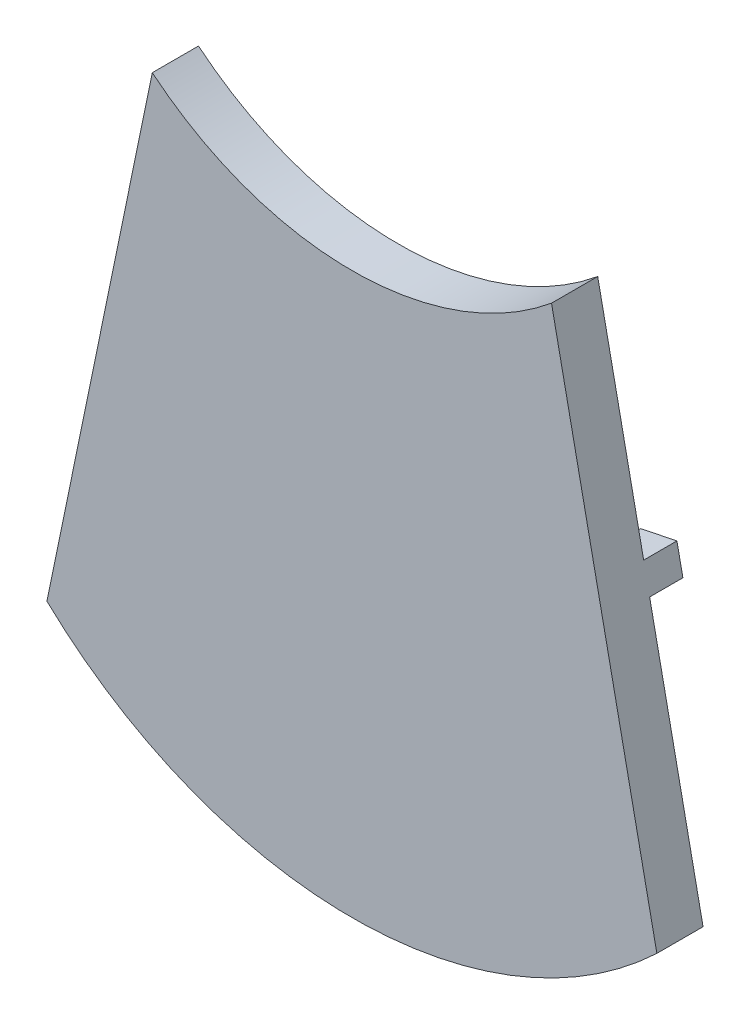
ISO-10303-21;
HEADER;
FILE_DESCRIPTION(('STEP AP214'),'2;1');
FILE_NAME('part.step','',(''),(''),'','','');
FILE_SCHEMA(('AUTOMOTIVE_DESIGN { 1 0 10303 214 1 1 1 1 }'));
ENDSEC;
DATA;
#1=APPLICATION_CONTEXT('core data for automotive mechanical design processes');
#2=APPLICATION_PROTOCOL_DEFINITION('international standard','automotive_design',2000,#1);
#3=PRODUCT_CONTEXT('',#1,'mechanical');
#4=PRODUCT('Part','Part','',(#3));
#5=PRODUCT_RELATED_PRODUCT_CATEGORY('part','',(#4));
#6=PRODUCT_DEFINITION_FORMATION('','',#4);
#7=PRODUCT_DEFINITION_CONTEXT('part definition',#1,'design');
#8=PRODUCT_DEFINITION('design','',#6,#7);
#9=PRODUCT_DEFINITION_SHAPE('','',#8);
#10=(LENGTH_UNIT() NAMED_UNIT(*) SI_UNIT(.MILLI.,.METRE.));
#11=(NAMED_UNIT(*) PLANE_ANGLE_UNIT() SI_UNIT($,.RADIAN.));
#12=(NAMED_UNIT(*) SI_UNIT($,.STERADIAN.) SOLID_ANGLE_UNIT());
#13=UNCERTAINTY_MEASURE_WITH_UNIT(LENGTH_MEASURE(1.E-05),#10,'distance_accuracy_value','');
#14=(GEOMETRIC_REPRESENTATION_CONTEXT(3) GLOBAL_UNCERTAINTY_ASSIGNED_CONTEXT((#13)) GLOBAL_UNIT_ASSIGNED_CONTEXT((#10,
#11,#12)) REPRESENTATION_CONTEXT('',''));
#15=CARTESIAN_POINT('',(0.,0.,0.));
#16=DIRECTION('',(0.,0.,1.));
#17=DIRECTION('',(1.,0.,0.));
#18=AXIS2_PLACEMENT_3D('',#15,#16,#17);
#19=CARTESIAN_POINT('',(104.775,110.670499117877,0.));
#20=DIRECTION('',(0.,0.,1.));
#21=DIRECTION('',(1.,0.,0.));
#22=AXIS2_PLACEMENT_3D('',#19,#20,#21);
#23=PLANE('',#22);
#24=DIRECTION('',(-0.979359182953296,-0.202127659574469,0.));
#25=VECTOR('',#24,1.);
#26=CARTESIAN_POINT('',(189.142180851064,98.8809999068796,0.));
#27=LINE('',#26,#25);
#28=CARTESIAN_POINT('',(189.142180851064,98.8809999068796,0.));
#29=VERTEX_POINT('',#28);
#30=CARTESIAN_POINT('',(176.704319227557,96.3139786302838,0.));
#31=VERTEX_POINT('',#30);
#32=EDGE_CURVE('E254',#29,#31,#27,.T.);
#33=ORIENTED_EDGE('',*,*,#32,.T.);
#34=DIRECTION('',(-0.202127659574468,0.979359182953296,0.));
#35=VECTOR('',#34,1.);
#36=CARTESIAN_POINT('',(170.923651063987,124.322765065139,0.));
#37=LINE('',#36,#35);
#38=CARTESIAN_POINT('',(164.783678837267,154.072469761542,0.));
#39=VERTEX_POINT('',#38);
#40=EDGE_CURVE('E216',#31,#39,#37,.T.);
#41=ORIENTED_EDGE('',*,*,#40,.T.);
#42=CARTESIAN_POINT('',(104.775,258.74042552741,0.));
#43=DIRECTION('',(0.,0.,1.));
#44=DIRECTION('',(1.,0.,0.));
#45=AXIS2_PLACEMENT_3D('',#42,#43,#44);
#46=CIRCLE('',#45,120.65);
#47=CARTESIAN_POINT('',(44.7663211627325,154.072469761542,0.));
#48=VERTEX_POINT('',#47);
#49=EDGE_CURVE('E11',#39,#48,#46,.F.);
#50=ORIENTED_EDGE('',*,*,#49,.T.);
#51=DIRECTION('',(-0.202127659574468,-0.979359182953296,0.));
#52=VECTOR('',#51,1.);
#53=CARTESIAN_POINT('',(38.6263489360134,124.322765065139,0.));
#54=LINE('',#53,#52);
#55=CARTESIAN_POINT('',(32.845680772443,96.3139786302838,0.));
#56=VERTEX_POINT('',#55);
#57=EDGE_CURVE('E227',#48,#56,#54,.T.);
#58=ORIENTED_EDGE('',*,*,#57,.T.);
#59=DIRECTION('',(-0.979359182953296,0.202127659574468,0.));
#60=VECTOR('',#59,1.);
#61=CARTESIAN_POINT('',(20.4078191489361,98.8809999068795,0.));
#62=LINE('',#61,#60);
#63=CARTESIAN_POINT('',(20.4078191489362,98.8809999068795,0.));
#64=VERTEX_POINT('',#63);
#65=EDGE_CURVE('E283',#56,#64,#62,.T.);
#66=ORIENTED_EDGE('',*,*,#65,.T.);
#67=DIRECTION('',(-0.202127659574468,-0.979359182953296,0.));
#68=VECTOR('',#67,1.);
#69=CARTESIAN_POINT('',(0.,0.,0.));
#70=LINE('',#69,#68);
#71=CARTESIAN_POINT('',(36.195,175.373848891447,0.));
#72=VERTEX_POINT('',#71);
#73=EDGE_CURVE('E301',#72,#64,#70,.T.);
#74=ORIENTED_EDGE('',*,*,#73,.F.);
#75=CARTESIAN_POINT('',(104.775,258.74042552741,0.));
#76=DIRECTION('',(0.,0.,-1.));
#77=DIRECTION('',(1.,0.,0.));
#78=AXIS2_PLACEMENT_3D('',#75,#76,#77);
#79=CIRCLE('',#78,107.95);
#80=CARTESIAN_POINT('',(173.355,175.373848891447,0.));
#81=VERTEX_POINT('',#80);
#82=EDGE_CURVE('E314',#81,#72,#79,.T.);
#83=ORIENTED_EDGE('',*,*,#82,.F.);
#84=DIRECTION('',(-0.202127659574468,0.979359182953296,0.));
#85=VECTOR('',#84,1.);
#86=CARTESIAN_POINT('',(173.355,175.373848891447,0.));
#87=LINE('',#86,#85);
#88=EDGE_CURVE('E310',#29,#81,#87,.T.);
#89=ORIENTED_EDGE('',*,*,#88,.F.);
#90=EDGE_LOOP('',(#33,#41,#50,#58,#66,#74,#83,#89));
#91=FACE_BOUND('',#90,.T.);
#92=ADVANCED_FACE('F32',(#91),#23,.F.);
#93=CARTESIAN_POINT('',(104.775,110.670499117877,15.875));
#94=DIRECTION('',(0.,0.,-1.));
#95=DIRECTION('',(-1.,0.,0.));
#96=AXIS2_PLACEMENT_3D('',#93,#94,#95);
#97=CYLINDRICAL_SURFACE('',#96,152.4);
#98=CARTESIAN_POINT('',(104.775,110.670499117877,0.));
#99=DIRECTION('',(0.,0.,1.));
#100=DIRECTION('',(1.,0.,0.));
#101=AXIS2_PLACEMENT_3D('',#98,#99,#100);
#102=CIRCLE('',#101,152.4);
#103=CARTESIAN_POINT('',(0.,0.,0.));
#104=VERTEX_POINT('',#103);
#105=CARTESIAN_POINT('',(209.55,0.,0.));
#106=VERTEX_POINT('',#105);
#107=EDGE_CURVE('E295',#104,#106,#102,.T.);
#108=ORIENTED_EDGE('',*,*,#107,.T.);
#109=DIRECTION('',(0.,0.,-1.));
#110=VECTOR('',#109,1.);
#111=CARTESIAN_POINT('',(209.55,0.,15.875));
#112=LINE('',#111,#110);
#113=CARTESIAN_POINT('',(209.55,0.,15.875));
#114=VERTEX_POINT('',#113);
#115=EDGE_CURVE('E40',#114,#106,#112,.T.);
#116=ORIENTED_EDGE('',*,*,#115,.F.);
#117=CARTESIAN_POINT('',(104.775,110.670499117877,15.875));
#118=DIRECTION('',(0.,0.,1.));
#119=DIRECTION('',(1.,0.,0.));
#120=AXIS2_PLACEMENT_3D('',#117,#118,#119);
#121=CIRCLE('',#120,152.4);
#122=CARTESIAN_POINT('',(0.,0.,15.875));
#123=VERTEX_POINT('',#122);
#124=EDGE_CURVE('E297',#123,#114,#121,.T.);
#125=ORIENTED_EDGE('',*,*,#124,.F.);
#126=DIRECTION('',(0.,0.,-1.));
#127=VECTOR('',#126,1.);
#128=CARTESIAN_POINT('',(0.,0.,15.875));
#129=LINE('',#128,#127);
#130=EDGE_CURVE('E307',#123,#104,#129,.T.);
#131=ORIENTED_EDGE('',*,*,#130,.T.);
#132=EDGE_LOOP('',(#108,#116,#125,#131));
#133=FACE_BOUND('',#132,.T.);
#134=ADVANCED_FACE('F34',(#133),#97,.T.);
#135=CARTESIAN_POINT('',(173.355,175.373848891447,15.875));
#136=DIRECTION('',(-0.979359182953296,-0.202127659574468,0.));
#137=DIRECTION('',(0.202127659574468,-0.979359182953296,0.));
#138=AXIS2_PLACEMENT_3D('',#135,#136,#137);
#139=PLANE('',#138);
#140=CARTESIAN_POINT('',(191.19579787234,88.9307106080741,0.));
#141=VERTEX_POINT('',#140);
#142=EDGE_CURVE('E311',#106,#141,#87,.T.);
#143=ORIENTED_EDGE('',*,*,#142,.T.);
#144=DIRECTION('',(0.,0.,1.));
#145=VECTOR('',#144,1.);
#146=CARTESIAN_POINT('',(191.19579787234,88.9307106080741,-11.43));
#147=LINE('',#146,#145);
#148=CARTESIAN_POINT('',(191.19579787234,88.9307106080741,-11.43));
#149=VERTEX_POINT('',#148);
#150=EDGE_CURVE('E274',#149,#141,#147,.T.);
#151=ORIENTED_EDGE('',*,*,#150,.F.);
#152=DIRECTION('',(-0.20212765957447,0.979359182953296,0.));
#153=VECTOR('',#152,1.);
#154=CARTESIAN_POINT('',(191.19579787234,88.9307106080741,-11.43));
#155=LINE('',#154,#153);
#156=CARTESIAN_POINT('',(189.142180851064,98.8809999068796,-11.43));
#157=VERTEX_POINT('',#156);
#158=EDGE_CURVE('E261',#149,#157,#155,.T.);
#159=ORIENTED_EDGE('',*,*,#158,.T.);
#160=DIRECTION('',(0.,0.,1.));
#161=VECTOR('',#160,1.);
#162=CARTESIAN_POINT('',(189.142180851064,98.8809999068796,-11.43));
#163=LINE('',#162,#161);
#164=EDGE_CURVE('E270',#157,#29,#163,.T.);
#165=ORIENTED_EDGE('',*,*,#164,.T.);
#166=ORIENTED_EDGE('',*,*,#88,.T.);
#167=DIRECTION('',(0.,0.,-1.));
#168=VECTOR('',#167,1.);
#169=CARTESIAN_POINT('',(173.355,175.373848891447,15.875));
#170=LINE('',#169,#168);
#171=CARTESIAN_POINT('',(173.355,175.373848891447,15.875));
#172=VERTEX_POINT('',#171);
#173=EDGE_CURVE('E324',#172,#81,#170,.T.);
#174=ORIENTED_EDGE('',*,*,#173,.F.);
#175=DIRECTION('',(-0.202127659574468,0.979359182953296,0.));
#176=VECTOR('',#175,1.);
#177=CARTESIAN_POINT('',(173.355,175.373848891447,15.875));
#178=LINE('',#177,#176);
#179=EDGE_CURVE('E300',#114,#172,#178,.T.);
#180=ORIENTED_EDGE('',*,*,#179,.F.);
#181=ORIENTED_EDGE('',*,*,#115,.T.);
#182=EDGE_LOOP('',(#143,#151,#159,#165,#166,#174,#180,#181));
#183=FACE_BOUND('',#182,.T.);
#184=ADVANCED_FACE('F329',(#183),#139,.F.);
#185=CARTESIAN_POINT('',(104.775,258.74042552741,15.875));
#186=DIRECTION('',(0.,0.,-1.));
#187=DIRECTION('',(-1.,0.,0.));
#188=AXIS2_PLACEMENT_3D('',#185,#186,#187);
#189=CYLINDRICAL_SURFACE('',#188,107.95);
#190=ORIENTED_EDGE('',*,*,#82,.T.);
#191=DIRECTION('',(0.,0.,-1.));
#192=VECTOR('',#191,1.);
#193=CARTESIAN_POINT('',(36.195,175.373848891447,15.875));
#194=LINE('',#193,#192);
#195=CARTESIAN_POINT('',(36.195,175.373848891447,15.875));
#196=VERTEX_POINT('',#195);
#197=EDGE_CURVE('E321',#196,#72,#194,.T.);
#198=ORIENTED_EDGE('',*,*,#197,.F.);
#199=CARTESIAN_POINT('',(104.775,258.74042552741,15.875));
#200=DIRECTION('',(0.,0.,-1.));
#201=DIRECTION('',(1.,0.,0.));
#202=AXIS2_PLACEMENT_3D('',#199,#200,#201);
#203=CIRCLE('',#202,107.95);
#204=EDGE_CURVE('E303',#172,#196,#203,.T.);
#205=ORIENTED_EDGE('',*,*,#204,.F.);
#206=ORIENTED_EDGE('',*,*,#173,.T.);
#207=EDGE_LOOP('',(#190,#198,#205,#206));
#208=FACE_BOUND('',#207,.T.);
#209=ADVANCED_FACE('F357',(#208),#189,.F.);
#210=CARTESIAN_POINT('',(0.,0.,15.875));
#211=DIRECTION('',(0.979359182953296,-0.202127659574468,0.));
#212=DIRECTION('',(0.202127659574468,0.979359182953296,0.));
#213=AXIS2_PLACEMENT_3D('',#210,#211,#212);
#214=PLANE('',#213);
#215=ORIENTED_EDGE('',*,*,#73,.T.);
#216=DIRECTION('',(0.,0.,1.));
#217=VECTOR('',#216,1.);
#218=CARTESIAN_POINT('',(20.4078191489361,98.8809999068795,-11.43));
#219=LINE('',#218,#217);
#220=CARTESIAN_POINT('',(20.4078191489361,98.8809999068795,-11.43));
#221=VERTEX_POINT('',#220);
#222=EDGE_CURVE('E292',#221,#64,#219,.T.);
#223=ORIENTED_EDGE('',*,*,#222,.F.);
#224=DIRECTION('',(-0.202127659574468,-0.979359182953296,0.));
#225=VECTOR('',#224,1.);
#226=CARTESIAN_POINT('',(18.3542021276596,88.930710608074,-11.43));
#227=LINE('',#226,#225);
#228=CARTESIAN_POINT('',(18.3542021276596,88.930710608074,-11.43));
#229=VERTEX_POINT('',#228);
#230=EDGE_CURVE('E279',#221,#229,#227,.T.);
#231=ORIENTED_EDGE('',*,*,#230,.T.);
#232=DIRECTION('',(0.,0.,1.));
#233=VECTOR('',#232,1.);
#234=CARTESIAN_POINT('',(18.3542021276596,88.930710608074,-11.43));
#235=LINE('',#234,#233);
#236=CARTESIAN_POINT('',(18.3542021276596,88.930710608074,0.));
#237=VERTEX_POINT('',#236);
#238=EDGE_CURVE('E288',#229,#237,#235,.T.);
#239=ORIENTED_EDGE('',*,*,#238,.T.);
#240=EDGE_CURVE('E316',#237,#104,#70,.T.);
#241=ORIENTED_EDGE('',*,*,#240,.T.);
#242=ORIENTED_EDGE('',*,*,#130,.F.);
#243=DIRECTION('',(-0.202127659574468,-0.979359182953296,0.));
#244=VECTOR('',#243,1.);
#245=CARTESIAN_POINT('',(0.,0.,15.875));
#246=LINE('',#245,#244);
#247=EDGE_CURVE('E305',#196,#123,#246,.T.);
#248=ORIENTED_EDGE('',*,*,#247,.F.);
#249=ORIENTED_EDGE('',*,*,#197,.T.);
#250=EDGE_LOOP('',(#215,#223,#231,#239,#241,#242,#248,#249));
#251=FACE_BOUND('',#250,.T.);
#252=ADVANCED_FACE('F364',(#251),#214,.F.);
#253=CARTESIAN_POINT('',(104.775,110.670499117877,15.875));
#254=DIRECTION('',(0.,0.,1.));
#255=DIRECTION('',(1.,0.,0.));
#256=AXIS2_PLACEMENT_3D('',#253,#254,#255);
#257=PLANE('',#256);
#258=ORIENTED_EDGE('',*,*,#124,.T.);
#259=ORIENTED_EDGE('',*,*,#179,.T.);
#260=ORIENTED_EDGE('',*,*,#204,.T.);
#261=ORIENTED_EDGE('',*,*,#247,.T.);
#262=EDGE_LOOP('',(#258,#259,#260,#261));
#263=FACE_BOUND('',#262,.T.);
#264=ADVANCED_FACE('F368',(#263),#257,.T.);
#265=CARTESIAN_POINT('',(104.775,110.670499117877,0.));
#266=DIRECTION('',(0.,0.,1.));
#267=DIRECTION('',(1.,0.,0.));
#268=AXIS2_PLACEMENT_3D('',#265,#266,#267);
#269=CIRCLE('',#268,125.363860821211);
#270=CARTESIAN_POINT('',(104.775,-14.6933617033342,0.));
#271=VERTEX_POINT('',#270);
#272=CARTESIAN_POINT('',(192.270924577821,20.8898732441824,0.));
#273=VERTEX_POINT('',#272);
#274=EDGE_CURVE('E208',#271,#273,#269,.T.);
#275=ORIENTED_EDGE('',*,*,#274,.T.);
#276=CARTESIAN_POINT('',(178.757936248834,86.3636893314783,0.));
#277=VERTEX_POINT('',#276);
#278=EDGE_CURVE('E220',#273,#277,#37,.T.);
#279=ORIENTED_EDGE('',*,*,#278,.T.);
#280=DIRECTION('',(0.979359182953296,0.202127659574468,0.));
#281=VECTOR('',#280,1.);
#282=CARTESIAN_POINT('',(172.53900543708,85.0801786931804,0.));
#283=LINE('',#282,#281);
#284=EDGE_CURVE('E265',#277,#141,#283,.T.);
#285=ORIENTED_EDGE('',*,*,#284,.T.);
#286=ORIENTED_EDGE('',*,*,#142,.F.);
#287=ORIENTED_EDGE('',*,*,#107,.F.);
#288=ORIENTED_EDGE('',*,*,#240,.F.);
#289=DIRECTION('',(0.979359182953296,-0.202127659574467,0.));
#290=VECTOR('',#289,1.);
#291=CARTESIAN_POINT('',(37.0109945629199,85.0801786931804,0.));
#292=LINE('',#291,#290);
#293=CARTESIAN_POINT('',(30.7920637511664,86.3636893314783,0.));
#294=VERTEX_POINT('',#293);
#295=EDGE_CURVE('E277',#237,#294,#292,.T.);
#296=ORIENTED_EDGE('',*,*,#295,.T.);
#297=CARTESIAN_POINT('',(17.2790754221793,20.8898732441824,0.));
#298=VERTEX_POINT('',#297);
#299=EDGE_CURVE('E224',#294,#298,#54,.T.);
#300=ORIENTED_EDGE('',*,*,#299,.T.);
#301=EDGE_CURVE('E180',#298,#271,#269,.T.);
#302=ORIENTED_EDGE('',*,*,#301,.T.);
#303=DIRECTION('',(-1.,0.,0.));
#304=VECTOR('',#303,1.);
#305=CARTESIAN_POINT('',(120.65,-14.6933617033342,0.));
#306=LINE('',#305,#304);
#307=CARTESIAN_POINT('',(88.9,-14.6933617033342,0.));
#308=VERTEX_POINT('',#307);
#309=EDGE_CURVE('E248',#271,#308,#306,.T.);
#310=ORIENTED_EDGE('',*,*,#309,.T.);
#311=DIRECTION('',(-0.125628140703519,-0.99207740134698,0.));
#312=VECTOR('',#311,1.);
#313=CARTESIAN_POINT('',(88.9,-14.6933617033342,0.));
#314=LINE('',#313,#312);
#315=CARTESIAN_POINT('',(88.1022613065326,-20.9930532018875,0.));
#316=VERTEX_POINT('',#315);
#317=EDGE_CURVE('E233',#308,#316,#314,.T.);
#318=ORIENTED_EDGE('',*,*,#317,.T.);
#319=CARTESIAN_POINT('',(104.775,110.670499117877,0.));
#320=DIRECTION('',(0.,0.,1.));
#321=DIRECTION('',(-1.,0.,0.));
#322=AXIS2_PLACEMENT_3D('',#319,#320,#321);
#323=CIRCLE('',#322,132.715);
#324=CARTESIAN_POINT('',(121.447738693467,-20.9930532018875,0.));
#325=VERTEX_POINT('',#324);
#326=EDGE_CURVE('E242',#316,#325,#323,.T.);
#327=ORIENTED_EDGE('',*,*,#326,.T.);
#328=DIRECTION('',(-0.125628140703519,0.99207740134698,0.));
#329=VECTOR('',#328,1.);
#330=CARTESIAN_POINT('',(121.447738693467,-20.9930532018875,0.));
#331=LINE('',#330,#329);
#332=CARTESIAN_POINT('',(120.65,-14.6933617033342,0.));
#333=VERTEX_POINT('',#332);
#334=EDGE_CURVE('E245',#325,#333,#331,.T.);
#335=ORIENTED_EDGE('',*,*,#334,.T.);
#336=EDGE_CURVE('E55',#333,#271,#306,.T.);
#337=ORIENTED_EDGE('',*,*,#336,.T.);
#338=EDGE_LOOP('',(#275,#279,#285,#286,#287,#288,#296,#300,#302,#310,#318,#327,#335,#337));
#339=FACE_BOUND('',#338,.T.);
#340=ADVANCED_FACE('F338',(#339),#23,.F.);
#341=CARTESIAN_POINT('',(20.4078191489361,98.8809999068795,-11.43));
#342=DIRECTION('',(0.202127659574468,0.979359182953296,0.));
#343=DIRECTION('',(-0.979359182953296,0.202127659574468,0.));
#344=AXIS2_PLACEMENT_3D('',#341,#342,#343);
#345=PLANE('',#344);
#346=DIRECTION('',(0.,0.,1.));
#347=VECTOR('',#346,1.);
#348=CARTESIAN_POINT('',(32.845680772443,96.3139786302838,-11.43));
#349=LINE('',#348,#347);
#350=CARTESIAN_POINT('',(32.845680772443,96.3139786302838,-11.43));
#351=VERTEX_POINT('',#350);
#352=EDGE_CURVE('E226',#351,#56,#349,.T.);
#353=ORIENTED_EDGE('',*,*,#352,.F.);
#354=DIRECTION('',(-0.979359182953296,0.202127659574468,0.));
#355=VECTOR('',#354,1.);
#356=CARTESIAN_POINT('',(20.4078191489361,98.8809999068795,-11.43));
#357=LINE('',#356,#355);
#358=EDGE_CURVE('E286',#351,#221,#357,.T.);
#359=ORIENTED_EDGE('',*,*,#358,.T.);
#360=ORIENTED_EDGE('',*,*,#222,.T.);
#361=ORIENTED_EDGE('',*,*,#65,.F.);
#362=EDGE_LOOP('',(#353,#359,#360,#361));
#363=FACE_BOUND('',#362,.T.);
#364=ADVANCED_FACE('F375',(#363),#345,.T.);
#365=CARTESIAN_POINT('',(37.0109945629199,85.0801786931804,-11.43));
#366=DIRECTION('',(-0.202127659574467,-0.979359182953296,0.));
#367=DIRECTION('',(0.979359182953297,-0.202127659574467,0.));
#368=AXIS2_PLACEMENT_3D('',#365,#366,#367);
#369=PLANE('',#368);
#370=DIRECTION('',(0.,0.,-1.));
#371=VECTOR('',#370,1.);
#372=CARTESIAN_POINT('',(30.7920637511664,86.3636893314783,-11.43));
#373=LINE('',#372,#371);
#374=CARTESIAN_POINT('',(30.7920637511664,86.3636893314783,-11.43));
#375=VERTEX_POINT('',#374);
#376=EDGE_CURVE('E222',#294,#375,#373,.T.);
#377=ORIENTED_EDGE('',*,*,#376,.F.);
#378=ORIENTED_EDGE('',*,*,#295,.F.);
#379=ORIENTED_EDGE('',*,*,#238,.F.);
#380=DIRECTION('',(0.979359182953296,-0.202127659574467,0.));
#381=VECTOR('',#380,1.);
#382=CARTESIAN_POINT('',(37.0109945629199,85.0801786931804,-11.43));
#383=LINE('',#382,#381);
#384=EDGE_CURVE('E282',#229,#375,#383,.T.);
#385=ORIENTED_EDGE('',*,*,#384,.T.);
#386=EDGE_LOOP('',(#377,#378,#379,#385));
#387=FACE_BOUND('',#386,.T.);
#388=ADVANCED_FACE('F458',(#387),#369,.T.);
#389=CARTESIAN_POINT('',(0.,0.,-11.43));
#390=DIRECTION('',(0.,0.,-1.));
#391=DIRECTION('',(-1.,0.,0.));
#392=AXIS2_PLACEMENT_3D('',#389,#390,#391);
#393=PLANE('',#392);
#394=DIRECTION('',(0.202127659574468,0.979359182953296,0.));
#395=VECTOR('',#394,1.);
#396=CARTESIAN_POINT('',(17.2790754221793,20.8898732441824,-11.43));
#397=LINE('',#396,#395);
#398=EDGE_CURVE('E200',#375,#351,#397,.T.);
#399=ORIENTED_EDGE('',*,*,#398,.F.);
#400=ORIENTED_EDGE('',*,*,#384,.F.);
#401=ORIENTED_EDGE('',*,*,#230,.F.);
#402=ORIENTED_EDGE('',*,*,#358,.F.);
#403=EDGE_LOOP('',(#399,#400,#401,#402));
#404=FACE_BOUND('',#403,.T.);
#405=ADVANCED_FACE('F468',(#404),#393,.T.);
#406=CARTESIAN_POINT('',(172.53900543708,85.0801786931804,-11.43));
#407=DIRECTION('',(0.202127659574468,-0.979359182953296,0.));
#408=DIRECTION('',(0.979359182953296,0.202127659574468,0.));
#409=AXIS2_PLACEMENT_3D('',#406,#407,#408);
#410=PLANE('',#409);
#411=DIRECTION('',(0.,0.,1.));
#412=VECTOR('',#411,1.);
#413=CARTESIAN_POINT('',(178.757936248834,86.3636893314783,-11.43));
#414=LINE('',#413,#412);
#415=CARTESIAN_POINT('',(178.757936248834,86.3636893314783,-11.43));
#416=VERTEX_POINT('',#415);
#417=EDGE_CURVE('E219',#416,#277,#414,.T.);
#418=ORIENTED_EDGE('',*,*,#417,.F.);
#419=DIRECTION('',(0.979359182953296,0.202127659574468,0.));
#420=VECTOR('',#419,1.);
#421=CARTESIAN_POINT('',(172.53900543708,85.0801786931804,-11.43));
#422=LINE('',#421,#420);
#423=EDGE_CURVE('E268',#416,#149,#422,.T.);
#424=ORIENTED_EDGE('',*,*,#423,.T.);
#425=ORIENTED_EDGE('',*,*,#150,.T.);
#426=ORIENTED_EDGE('',*,*,#284,.F.);
#427=EDGE_LOOP('',(#418,#424,#425,#426));
#428=FACE_BOUND('',#427,.T.);
#429=ADVANCED_FACE('F343',(#428),#410,.T.);
#430=CARTESIAN_POINT('',(189.142180851064,98.8809999068796,-11.43));
#431=DIRECTION('',(-0.202127659574469,0.979359182953296,0.));
#432=DIRECTION('',(-0.979359182953296,-0.202127659574469,0.));
#433=AXIS2_PLACEMENT_3D('',#430,#431,#432);
#434=PLANE('',#433);
#435=DIRECTION('',(0.,0.,-1.));
#436=VECTOR('',#435,1.);
#437=CARTESIAN_POINT('',(176.704319227557,96.3139786302838,-11.43));
#438=LINE('',#437,#436);
#439=CARTESIAN_POINT('',(176.704319227557,96.3139786302838,-11.43));
#440=VERTEX_POINT('',#439);
#441=EDGE_CURVE('E47',#31,#440,#438,.T.);
#442=ORIENTED_EDGE('',*,*,#441,.F.);
#443=ORIENTED_EDGE('',*,*,#32,.F.);
#444=ORIENTED_EDGE('',*,*,#164,.F.);
#445=DIRECTION('',(-0.979359182953296,-0.202127659574469,0.));
#446=VECTOR('',#445,1.);
#447=CARTESIAN_POINT('',(189.142180851064,98.8809999068796,-11.43));
#448=LINE('',#447,#446);
#449=EDGE_CURVE('E264',#157,#440,#448,.T.);
#450=ORIENTED_EDGE('',*,*,#449,.T.);
#451=EDGE_LOOP('',(#442,#443,#444,#450));
#452=FACE_BOUND('',#451,.T.);
#453=ADVANCED_FACE('F350',(#452),#434,.T.);
#454=CARTESIAN_POINT('',(0.,0.,-11.43));
#455=DIRECTION('',(0.,0.,1.));
#456=DIRECTION('',(1.,0.,0.));
#457=AXIS2_PLACEMENT_3D('',#454,#455,#456);
#458=PLANE('',#457);
#459=ORIENTED_EDGE('',*,*,#423,.F.);
#460=DIRECTION('',(0.202127659574469,-0.979359182953296,0.));
#461=VECTOR('',#460,1.);
#462=CARTESIAN_POINT('',(164.783678837267,154.072469761542,-11.43));
#463=LINE('',#462,#461);
#464=EDGE_CURVE('E198',#440,#416,#463,.T.);
#465=ORIENTED_EDGE('',*,*,#464,.F.);
#466=ORIENTED_EDGE('',*,*,#449,.F.);
#467=ORIENTED_EDGE('',*,*,#158,.F.);
#468=EDGE_LOOP('',(#459,#465,#466,#467));
#469=FACE_BOUND('',#468,.T.);
#470=ADVANCED_FACE('F348',(#469),#458,.F.);
#471=CARTESIAN_POINT('',(104.775,110.670499117877,-11.43));
#472=DIRECTION('',(0.,0.,1.));
#473=DIRECTION('',(1.,0.,0.));
#474=AXIS2_PLACEMENT_3D('',#471,#472,#473);
#475=CYLINDRICAL_SURFACE('',#474,132.715);
#476=ORIENTED_EDGE('',*,*,#326,.F.);
#477=DIRECTION('',(0.,0.,1.));
#478=VECTOR('',#477,1.);
#479=CARTESIAN_POINT('',(88.1022613065326,-20.9930532018875,-11.43));
#480=LINE('',#479,#478);
#481=CARTESIAN_POINT('',(88.1022613065326,-20.9930532018875,-11.43));
#482=VERTEX_POINT('',#481);
#483=EDGE_CURVE('E252',#482,#316,#480,.T.);
#484=ORIENTED_EDGE('',*,*,#483,.F.);
#485=CARTESIAN_POINT('',(104.775,110.670499117877,-11.43));
#486=DIRECTION('',(0.,0.,1.));
#487=DIRECTION('',(-1.,0.,0.));
#488=AXIS2_PLACEMENT_3D('',#485,#486,#487);
#489=CIRCLE('',#488,132.715);
#490=CARTESIAN_POINT('',(121.447738693467,-20.9930532018875,-11.43));
#491=VERTEX_POINT('',#490);
#492=EDGE_CURVE('E229',#482,#491,#489,.T.);
#493=ORIENTED_EDGE('',*,*,#492,.T.);
#494=DIRECTION('',(0.,0.,1.));
#495=VECTOR('',#494,1.);
#496=CARTESIAN_POINT('',(121.447738693467,-20.9930532018875,-11.43));
#497=LINE('',#496,#495);
#498=EDGE_CURVE('E241',#491,#325,#497,.T.);
#499=ORIENTED_EDGE('',*,*,#498,.T.);
#500=EDGE_LOOP('',(#476,#484,#493,#499));
#501=FACE_BOUND('',#500,.T.);
#502=ADVANCED_FACE('F405',(#501),#475,.T.);
#503=CARTESIAN_POINT('',(88.9,-14.6933617033342,-11.43));
#504=DIRECTION('',(-0.99207740134698,0.125628140703519,0.));
#505=DIRECTION('',(-0.125628140703519,-0.99207740134698,0.));
#506=AXIS2_PLACEMENT_3D('',#503,#504,#505);
#507=PLANE('',#506);
#508=ORIENTED_EDGE('',*,*,#317,.F.);
#509=DIRECTION('',(0.,0.,1.));
#510=VECTOR('',#509,1.);
#511=CARTESIAN_POINT('',(88.9,-14.6933617033342,-11.43));
#512=LINE('',#511,#510);
#513=CARTESIAN_POINT('',(88.9,-14.6933617033342,-11.43));
#514=VERTEX_POINT('',#513);
#515=EDGE_CURVE('E255',#514,#308,#512,.T.);
#516=ORIENTED_EDGE('',*,*,#515,.F.);
#517=DIRECTION('',(-0.125628140703519,-0.99207740134698,0.));
#518=VECTOR('',#517,1.);
#519=CARTESIAN_POINT('',(88.9,-14.6933617033342,-11.43));
#520=LINE('',#519,#518);
#521=EDGE_CURVE('E238',#514,#482,#520,.T.);
#522=ORIENTED_EDGE('',*,*,#521,.T.);
#523=ORIENTED_EDGE('',*,*,#483,.T.);
#524=EDGE_LOOP('',(#508,#516,#522,#523));
#525=FACE_BOUND('',#524,.T.);
#526=ADVANCED_FACE('F410',(#525),#507,.T.);
#527=CARTESIAN_POINT('',(120.65,-14.6933617033342,-11.43));
#528=DIRECTION('',(0.,1.,0.));
#529=DIRECTION('',(0.,0.,1.));
#530=AXIS2_PLACEMENT_3D('',#527,#528,#529);
#531=PLANE('',#530);
#532=DIRECTION('',(-1.,0.,0.));
#533=VECTOR('',#532,1.);
#534=CARTESIAN_POINT('',(120.65,-14.6933617033342,-11.43));
#535=LINE('',#534,#533);
#536=CARTESIAN_POINT('',(120.65,-14.6933617033342,-11.43));
#537=VERTEX_POINT('',#536);
#538=EDGE_CURVE('E236',#537,#514,#535,.T.);
#539=ORIENTED_EDGE('',*,*,#538,.T.);
#540=ORIENTED_EDGE('',*,*,#515,.T.);
#541=ORIENTED_EDGE('',*,*,#309,.F.);
#542=ORIENTED_EDGE('',*,*,#336,.F.);
#543=DIRECTION('',(0.,0.,1.));
#544=VECTOR('',#543,1.);
#545=CARTESIAN_POINT('',(120.65,-14.6933617033342,-11.43));
#546=LINE('',#545,#544);
#547=EDGE_CURVE('E258',#537,#333,#546,.T.);
#548=ORIENTED_EDGE('',*,*,#547,.F.);
#549=EDGE_LOOP('',(#539,#540,#541,#542,#548));
#550=FACE_BOUND('',#549,.T.);
#551=ADVANCED_FACE('F422',(#550),#531,.T.);
#552=CARTESIAN_POINT('',(121.447738693467,-20.9930532018875,-11.43));
#553=DIRECTION('',(0.99207740134698,0.125628140703519,0.));
#554=DIRECTION('',(-0.125628140703519,0.99207740134698,0.));
#555=AXIS2_PLACEMENT_3D('',#552,#553,#554);
#556=PLANE('',#555);
#557=ORIENTED_EDGE('',*,*,#334,.F.);
#558=ORIENTED_EDGE('',*,*,#498,.F.);
#559=DIRECTION('',(-0.125628140703519,0.99207740134698,0.));
#560=VECTOR('',#559,1.);
#561=CARTESIAN_POINT('',(121.447738693467,-20.9930532018875,-11.43));
#562=LINE('',#561,#560);
#563=EDGE_CURVE('E232',#491,#537,#562,.T.);
#564=ORIENTED_EDGE('',*,*,#563,.T.);
#565=ORIENTED_EDGE('',*,*,#547,.T.);
#566=EDGE_LOOP('',(#557,#558,#564,#565));
#567=FACE_BOUND('',#566,.T.);
#568=ADVANCED_FACE('F430',(#567),#556,.T.);
#569=CARTESIAN_POINT('',(104.775,110.670499117877,-11.43));
#570=DIRECTION('',(0.,0.,-1.));
#571=DIRECTION('',(-1.,0.,0.));
#572=AXIS2_PLACEMENT_3D('',#569,#570,#571);
#573=PLANE('',#572);
#574=ORIENTED_EDGE('',*,*,#492,.F.);
#575=ORIENTED_EDGE('',*,*,#521,.F.);
#576=ORIENTED_EDGE('',*,*,#538,.F.);
#577=ORIENTED_EDGE('',*,*,#563,.F.);
#578=EDGE_LOOP('',(#574,#575,#576,#577));
#579=FACE_BOUND('',#578,.T.);
#580=ADVANCED_FACE('F434',(#579),#573,.T.);
#581=CARTESIAN_POINT('',(104.775,258.74042552741,11.1125));
#582=DIRECTION('',(0.,0.,-1.));
#583=DIRECTION('',(-1.,0.,0.));
#584=AXIS2_PLACEMENT_3D('',#581,#582,#583);
#585=CYLINDRICAL_SURFACE('',#584,120.65);
#586=DIRECTION('',(0.,0.,-1.));
#587=VECTOR('',#586,1.);
#588=CARTESIAN_POINT('',(164.783678837267,154.072469761542,11.1125));
#589=LINE('',#588,#587);
#590=CARTESIAN_POINT('',(164.783678837267,154.072469761542,11.1125));
#591=VERTEX_POINT('',#590);
#592=EDGE_CURVE('E209',#591,#39,#589,.T.);
#593=ORIENTED_EDGE('',*,*,#592,.F.);
#594=CARTESIAN_POINT('',(104.775,258.74042552741,11.1125));
#595=DIRECTION('',(0.,0.,1.));
#596=DIRECTION('',(-1.,0.,0.));
#597=AXIS2_PLACEMENT_3D('',#594,#595,#596);
#598=CIRCLE('',#597,120.65);
#599=CARTESIAN_POINT('',(44.7663211627325,154.072469761542,11.1125));
#600=VERTEX_POINT('',#599);
#601=EDGE_CURVE('E193',#600,#591,#598,.T.);
#602=ORIENTED_EDGE('',*,*,#601,.F.);
#603=DIRECTION('',(0.,0.,-1.));
#604=VECTOR('',#603,1.);
#605=CARTESIAN_POINT('',(44.7663211627325,154.072469761542,11.1125));
#606=LINE('',#605,#604);
#607=EDGE_CURVE('E183',#600,#48,#606,.T.);
#608=ORIENTED_EDGE('',*,*,#607,.T.);
#609=ORIENTED_EDGE('',*,*,#49,.F.);
#610=EDGE_LOOP('',(#593,#602,#608,#609));
#611=FACE_BOUND('',#610,.T.);
#612=ADVANCED_FACE('F512',(#611),#585,.T.);
#613=CARTESIAN_POINT('',(35.4127020490388,108.751840253791,11.1125));
#614=DIRECTION('',(-0.979359182953296,0.202127659574468,0.));
#615=DIRECTION('',(-0.202127659574468,-0.979359182953296,0.));
#616=AXIS2_PLACEMENT_3D('',#613,#614,#615);
#617=PLANE('',#616);
#618=ORIENTED_EDGE('',*,*,#607,.F.);
#619=DIRECTION('',(0.202127659574468,0.979359182953296,0.));
#620=VECTOR('',#619,1.);
#621=CARTESIAN_POINT('',(17.2790754221793,20.8898732441824,11.1125));
#622=LINE('',#621,#620);
#623=CARTESIAN_POINT('',(17.2790754221793,20.8898732441824,11.1125));
#624=VERTEX_POINT('',#623);
#625=EDGE_CURVE('E187',#624,#600,#622,.T.);
#626=ORIENTED_EDGE('',*,*,#625,.F.);
#627=DIRECTION('',(0.,0.,-1.));
#628=VECTOR('',#627,1.);
#629=CARTESIAN_POINT('',(17.2790754221793,20.8898732441824,11.1125));
#630=LINE('',#629,#628);
#631=EDGE_CURVE('E173',#624,#298,#630,.T.);
#632=ORIENTED_EDGE('',*,*,#631,.T.);
#633=ORIENTED_EDGE('',*,*,#299,.F.);
#634=ORIENTED_EDGE('',*,*,#376,.T.);
#635=ORIENTED_EDGE('',*,*,#398,.T.);
#636=ORIENTED_EDGE('',*,*,#352,.T.);
#637=ORIENTED_EDGE('',*,*,#57,.F.);
#638=EDGE_LOOP('',(#618,#626,#632,#633,#634,#635,#636,#637));
#639=FACE_BOUND('',#638,.T.);
#640=ADVANCED_FACE('F188',(#639),#617,.F.);
#641=CARTESIAN_POINT('',(181.324957525429,73.9258277079715,11.1125));
#642=DIRECTION('',(0.979359182953296,0.202127659574468,0.));
#643=DIRECTION('',(-0.202127659574468,0.979359182953296,0.));
#644=AXIS2_PLACEMENT_3D('',#641,#642,#643);
#645=PLANE('',#644);
#646=DIRECTION('',(0.,0.,-1.));
#647=VECTOR('',#646,1.);
#648=CARTESIAN_POINT('',(192.270924577821,20.8898732441824,11.1125));
#649=LINE('',#648,#647);
#650=CARTESIAN_POINT('',(192.270924577821,20.8898732441824,11.1125));
#651=VERTEX_POINT('',#650);
#652=EDGE_CURVE('E206',#651,#273,#649,.T.);
#653=ORIENTED_EDGE('',*,*,#652,.F.);
#654=DIRECTION('',(0.202127659574469,-0.979359182953296,0.));
#655=VECTOR('',#654,1.);
#656=CARTESIAN_POINT('',(164.783678837267,154.072469761542,11.1125));
#657=LINE('',#656,#655);
#658=EDGE_CURVE('E184',#591,#651,#657,.T.);
#659=ORIENTED_EDGE('',*,*,#658,.F.);
#660=ORIENTED_EDGE('',*,*,#592,.T.);
#661=ORIENTED_EDGE('',*,*,#40,.F.);
#662=ORIENTED_EDGE('',*,*,#441,.T.);
#663=ORIENTED_EDGE('',*,*,#464,.T.);
#664=ORIENTED_EDGE('',*,*,#417,.T.);
#665=ORIENTED_EDGE('',*,*,#278,.F.);
#666=EDGE_LOOP('',(#653,#659,#660,#661,#662,#663,#664,#665));
#667=FACE_BOUND('',#666,.T.);
#668=ADVANCED_FACE('F531',(#667),#645,.F.);
#669=CARTESIAN_POINT('',(104.775,110.670499117877,11.1125));
#670=DIRECTION('',(0.,0.,-1.));
#671=DIRECTION('',(-1.,0.,0.));
#672=AXIS2_PLACEMENT_3D('',#669,#670,#671);
#673=CYLINDRICAL_SURFACE('',#672,125.363860821211);
#674=ORIENTED_EDGE('',*,*,#631,.F.);
#675=CARTESIAN_POINT('',(104.775,110.670499117877,11.1125));
#676=DIRECTION('',(0.,0.,-1.));
#677=DIRECTION('',(-1.,0.,0.));
#678=AXIS2_PLACEMENT_3D('',#675,#676,#677);
#679=CIRCLE('',#678,125.363860821211);
#680=EDGE_CURVE('E178',#651,#624,#679,.T.);
#681=ORIENTED_EDGE('',*,*,#680,.F.);
#682=ORIENTED_EDGE('',*,*,#652,.T.);
#683=ORIENTED_EDGE('',*,*,#274,.F.);
#684=ORIENTED_EDGE('',*,*,#301,.F.);
#685=EDGE_LOOP('',(#674,#681,#682,#683,#684));
#686=FACE_BOUND('',#685,.T.);
#687=ADVANCED_FACE('F175',(#686),#673,.F.);
#688=CARTESIAN_POINT('',(104.775,110.670499117877,11.1125));
#689=DIRECTION('',(0.,0.,-1.));
#690=DIRECTION('',(-1.,0.,0.));
#691=AXIS2_PLACEMENT_3D('',#688,#689,#690);
#692=PLANE('',#691);
#693=ORIENTED_EDGE('',*,*,#680,.T.);
#694=ORIENTED_EDGE('',*,*,#625,.T.);
#695=ORIENTED_EDGE('',*,*,#601,.T.);
#696=ORIENTED_EDGE('',*,*,#658,.T.);
#697=EDGE_LOOP('',(#693,#694,#695,#696));
#698=FACE_BOUND('',#697,.T.);
#699=ADVANCED_FACE('F195',(#698),#692,.T.);
#700=CLOSED_SHELL('',(#92,#134,#184,#209,#252,#264,#340,#364,#388,#405,#429,#453,#470,#502,#526,
#551,#568,#580,#612,#640,#668,#687,#699));
#701=MANIFOLD_SOLID_BREP('B2',#700);
#702=ADVANCED_BREP_SHAPE_REPRESENTATION('',(#18,#701),#14);
#703=SHAPE_DEFINITION_REPRESENTATION(#9,#702);
ENDSEC;
END-ISO-10303-21;
